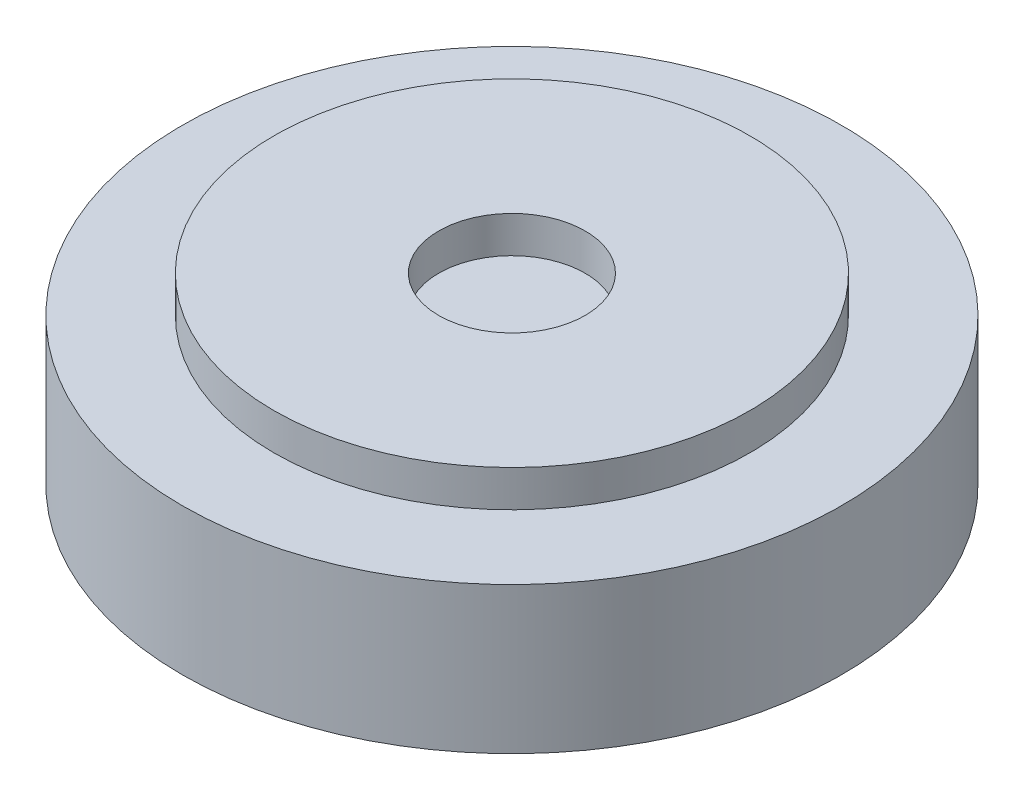
ISO-10303-21;
HEADER;
FILE_DESCRIPTION(('STEP AP214'),'2;1');
FILE_NAME('part.step','',(''),(''),'','','');
FILE_SCHEMA(('AUTOMOTIVE_DESIGN { 1 0 10303 214 1 1 1 1 }'));
ENDSEC;
DATA;
#1=APPLICATION_CONTEXT('core data for automotive mechanical design processes');
#2=APPLICATION_PROTOCOL_DEFINITION('international standard','automotive_design',2000,#1);
#3=PRODUCT_CONTEXT('',#1,'mechanical');
#4=PRODUCT('Part','Part','',(#3));
#5=PRODUCT_RELATED_PRODUCT_CATEGORY('part','',(#4));
#6=PRODUCT_DEFINITION_FORMATION('','',#4);
#7=PRODUCT_DEFINITION_CONTEXT('part definition',#1,'design');
#8=PRODUCT_DEFINITION('design','',#6,#7);
#9=PRODUCT_DEFINITION_SHAPE('','',#8);
#10=(LENGTH_UNIT() NAMED_UNIT(*) SI_UNIT(.MILLI.,.METRE.));
#11=(NAMED_UNIT(*) PLANE_ANGLE_UNIT() SI_UNIT($,.RADIAN.));
#12=(NAMED_UNIT(*) SI_UNIT($,.STERADIAN.) SOLID_ANGLE_UNIT());
#13=UNCERTAINTY_MEASURE_WITH_UNIT(LENGTH_MEASURE(1.E-05),#10,'distance_accuracy_value','');
#14=(GEOMETRIC_REPRESENTATION_CONTEXT(3) GLOBAL_UNCERTAINTY_ASSIGNED_CONTEXT((#13)) GLOBAL_UNIT_ASSIGNED_CONTEXT((#10,
#11,#12)) REPRESENTATION_CONTEXT('',''));
#15=CARTESIAN_POINT('',(0.,0.,0.));
#16=DIRECTION('',(0.,0.,1.));
#17=DIRECTION('',(1.,0.,0.));
#18=AXIS2_PLACEMENT_3D('',#15,#16,#17);
#19=CARTESIAN_POINT('',(0.,5.,0.));
#20=DIRECTION('',(0.,-1.,0.));
#21=DIRECTION('',(0.,0.,-1.));
#22=AXIS2_PLACEMENT_3D('',#19,#20,#21);
#23=CYLINDRICAL_SURFACE('',#22,9.);
#24=CARTESIAN_POINT('',(0.,0.,0.));
#25=DIRECTION('',(0.,1.,0.));
#26=DIRECTION('',(0.,0.,1.));
#27=AXIS2_PLACEMENT_3D('',#24,#25,#26);
#28=CIRCLE('',#27,9.);
#29=CARTESIAN_POINT('',(0.,0.,9.));
#30=VERTEX_POINT('',#29);
#31=EDGE_CURVE('E11',#30,#30,#28,.T.);
#32=ORIENTED_EDGE('',*,*,#31,.T.);
#33=EDGE_LOOP('',(#32));
#34=FACE_BOUND('',#33,.T.);
#35=CARTESIAN_POINT('',(0.,4.,0.));
#36=DIRECTION('',(0.,1.,0.));
#37=DIRECTION('',(0.,0.,1.));
#38=AXIS2_PLACEMENT_3D('',#35,#36,#37);
#39=CIRCLE('',#38,9.);
#40=CARTESIAN_POINT('',(0.,4.,9.));
#41=VERTEX_POINT('',#40);
#42=EDGE_CURVE('E36',#41,#41,#39,.T.);
#43=ORIENTED_EDGE('',*,*,#42,.F.);
#44=EDGE_LOOP('',(#43));
#45=FACE_BOUND('',#44,.T.);
#46=ADVANCED_FACE('F33',(#34,#45),#23,.T.);
#47=CARTESIAN_POINT('',(0.,0.,0.));
#48=DIRECTION('',(0.,1.,0.));
#49=DIRECTION('',(0.,0.,1.));
#50=AXIS2_PLACEMENT_3D('',#47,#48,#49);
#51=PLANE('',#50);
#52=ORIENTED_EDGE('',*,*,#31,.F.);
#53=EDGE_LOOP('',(#52));
#54=FACE_BOUND('',#53,.T.);
#55=ADVANCED_FACE('F79',(#54),#51,.F.);
#56=CARTESIAN_POINT('',(0.,4.,0.));
#57=DIRECTION('',(0.,1.,0.));
#58=DIRECTION('',(0.,0.,1.));
#59=AXIS2_PLACEMENT_3D('',#56,#57,#58);
#60=PLANE('',#59);
#61=CARTESIAN_POINT('',(0.,4.,0.));
#62=DIRECTION('',(0.,1.,0.));
#63=DIRECTION('',(0.,0.,1.));
#64=AXIS2_PLACEMENT_3D('',#61,#62,#63);
#65=CIRCLE('',#64,6.5);
#66=CARTESIAN_POINT('',(0.,4.,6.5));
#67=VERTEX_POINT('',#66);
#68=EDGE_CURVE('E43',#67,#67,#65,.T.);
#69=ORIENTED_EDGE('',*,*,#68,.F.);
#70=EDGE_LOOP('',(#69));
#71=FACE_BOUND('',#70,.T.);
#72=ORIENTED_EDGE('',*,*,#42,.T.);
#73=EDGE_LOOP('',(#72));
#74=FACE_BOUND('',#73,.T.);
#75=ADVANCED_FACE('F73',(#71,#74),#60,.T.);
#76=CARTESIAN_POINT('',(0.,4.,0.));
#77=DIRECTION('',(0.,1.,0.));
#78=DIRECTION('',(0.,0.,1.));
#79=AXIS2_PLACEMENT_3D('',#76,#77,#78);
#80=CYLINDRICAL_SURFACE('',#79,6.5);
#81=ORIENTED_EDGE('',*,*,#68,.T.);
#82=EDGE_LOOP('',(#81));
#83=FACE_BOUND('',#82,.T.);
#84=CARTESIAN_POINT('',(0.,5.,0.));
#85=DIRECTION('',(0.,1.,0.));
#86=DIRECTION('',(0.,0.,1.));
#87=AXIS2_PLACEMENT_3D('',#84,#85,#86);
#88=CIRCLE('',#87,6.5);
#89=CARTESIAN_POINT('',(0.,5.,6.5));
#90=VERTEX_POINT('',#89);
#91=EDGE_CURVE('E45',#90,#90,#88,.T.);
#92=ORIENTED_EDGE('',*,*,#91,.F.);
#93=EDGE_LOOP('',(#92));
#94=FACE_BOUND('',#93,.T.);
#95=ADVANCED_FACE('F68',(#83,#94),#80,.T.);
#96=CARTESIAN_POINT('',(0.,5.,0.));
#97=DIRECTION('',(0.,1.,0.));
#98=DIRECTION('',(0.,0.,1.));
#99=AXIS2_PLACEMENT_3D('',#96,#97,#98);
#100=PLANE('',#99);
#101=CARTESIAN_POINT('',(0.,5.,0.));
#102=DIRECTION('',(0.,1.,0.));
#103=DIRECTION('',(0.,0.,1.));
#104=AXIS2_PLACEMENT_3D('',#101,#102,#103);
#105=CIRCLE('',#104,2.);
#106=CARTESIAN_POINT('',(0.,5.,2.));
#107=VERTEX_POINT('',#106);
#108=EDGE_CURVE('E51',#107,#107,#105,.T.);
#109=ORIENTED_EDGE('',*,*,#108,.F.);
#110=EDGE_LOOP('',(#109));
#111=FACE_BOUND('',#110,.T.);
#112=ORIENTED_EDGE('',*,*,#91,.T.);
#113=EDGE_LOOP('',(#112));
#114=FACE_BOUND('',#113,.T.);
#115=ADVANCED_FACE('F62',(#111,#114),#100,.T.);
#116=CARTESIAN_POINT('',(0.,4.,0.));
#117=DIRECTION('',(0.,1.,0.));
#118=DIRECTION('',(0.,0.,1.));
#119=AXIS2_PLACEMENT_3D('',#116,#117,#118);
#120=CYLINDRICAL_SURFACE('',#119,2.);
#121=CARTESIAN_POINT('',(0.,4.,0.));
#122=DIRECTION('',(0.,1.,0.));
#123=DIRECTION('',(0.,0.,1.));
#124=AXIS2_PLACEMENT_3D('',#121,#122,#123);
#125=CIRCLE('',#124,2.);
#126=CARTESIAN_POINT('',(0.,4.,2.));
#127=VERTEX_POINT('',#126);
#128=EDGE_CURVE('E48',#127,#127,#125,.T.);
#129=ORIENTED_EDGE('',*,*,#128,.F.);
#130=EDGE_LOOP('',(#129));
#131=FACE_BOUND('',#130,.T.);
#132=ORIENTED_EDGE('',*,*,#108,.T.);
#133=EDGE_LOOP('',(#132));
#134=FACE_BOUND('',#133,.T.);
#135=ADVANCED_FACE('F59',(#131,#134),#120,.F.);
#136=CARTESIAN_POINT('',(0.,4.,0.));
#137=DIRECTION('',(0.,1.,0.));
#138=DIRECTION('',(0.,0.,1.));
#139=AXIS2_PLACEMENT_3D('',#136,#137,#138);
#140=PLANE('',#139);
#141=ORIENTED_EDGE('',*,*,#128,.T.);
#142=EDGE_LOOP('',(#141));
#143=FACE_BOUND('',#142,.T.);
#144=ADVANCED_FACE('F57',(#143),#140,.T.);
#145=CLOSED_SHELL('',(#46,#55,#75,#95,#115,#135,#144));
#146=MANIFOLD_SOLID_BREP('B2',#145);
#147=ADVANCED_BREP_SHAPE_REPRESENTATION('',(#18,#146),#14);
#148=SHAPE_DEFINITION_REPRESENTATION(#9,#147);
ENDSEC;
END-ISO-10303-21;
